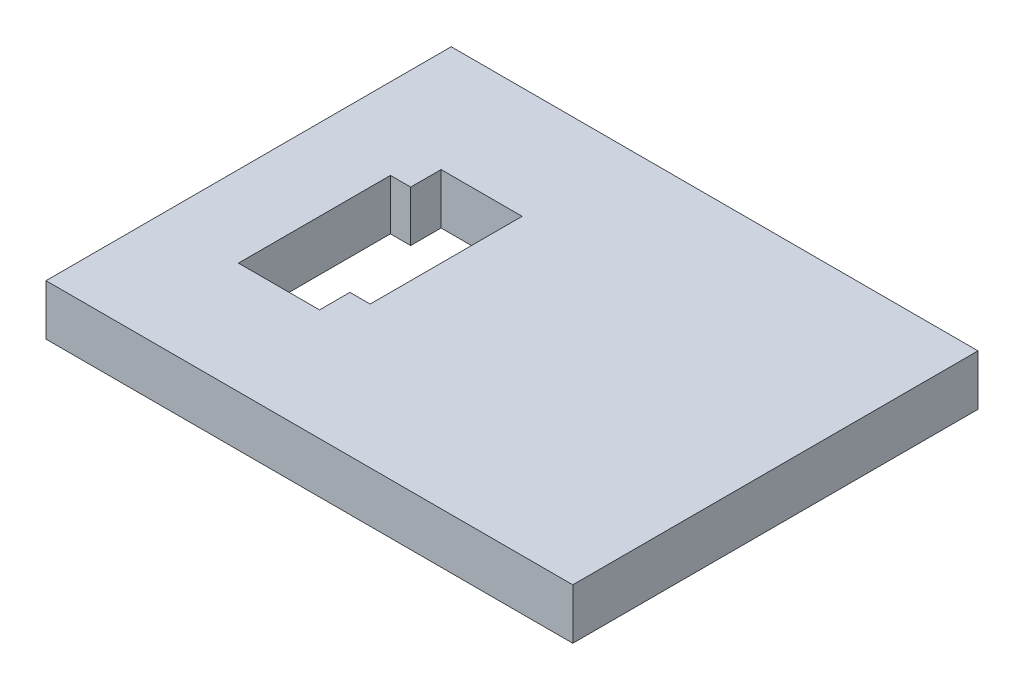
ISO-10303-21;
HEADER;
FILE_DESCRIPTION(('STEP AP214'),'2;1');
FILE_NAME('part.step','',(''),(''),'','','');
FILE_SCHEMA(('AUTOMOTIVE_DESIGN { 1 0 10303 214 1 1 1 1 }'));
ENDSEC;
DATA;
#1=APPLICATION_CONTEXT('core data for automotive mechanical design processes');
#2=APPLICATION_PROTOCOL_DEFINITION('international standard','automotive_design',2000,#1);
#3=PRODUCT_CONTEXT('',#1,'mechanical');
#4=PRODUCT('Part','Part','',(#3));
#5=PRODUCT_RELATED_PRODUCT_CATEGORY('part','',(#4));
#6=PRODUCT_DEFINITION_FORMATION('','',#4);
#7=PRODUCT_DEFINITION_CONTEXT('part definition',#1,'design');
#8=PRODUCT_DEFINITION('design','',#6,#7);
#9=PRODUCT_DEFINITION_SHAPE('','',#8);
#10=(LENGTH_UNIT() NAMED_UNIT(*) SI_UNIT(.MILLI.,.METRE.));
#11=(NAMED_UNIT(*) PLANE_ANGLE_UNIT() SI_UNIT($,.RADIAN.));
#12=(NAMED_UNIT(*) SI_UNIT($,.STERADIAN.) SOLID_ANGLE_UNIT());
#13=UNCERTAINTY_MEASURE_WITH_UNIT(LENGTH_MEASURE(1.E-05),#10,'distance_accuracy_value','');
#14=(GEOMETRIC_REPRESENTATION_CONTEXT(3) GLOBAL_UNCERTAINTY_ASSIGNED_CONTEXT((#13)) GLOBAL_UNIT_ASSIGNED_CONTEXT((#10,
#11,#12)) REPRESENTATION_CONTEXT('',''));
#15=CARTESIAN_POINT('',(0.,0.,0.));
#16=DIRECTION('',(0.,0.,1.));
#17=DIRECTION('',(1.,0.,0.));
#18=AXIS2_PLACEMENT_3D('',#15,#16,#17);
#19=CARTESIAN_POINT('',(2.,74.5000000000002,20.));
#20=DIRECTION('',(0.,0.,1.));
#21=DIRECTION('',(1.,0.,0.));
#22=AXIS2_PLACEMENT_3D('',#19,#20,#21);
#23=PLANE('',#22);
#24=DIRECTION('',(-1.,0.,0.));
#25=VECTOR('',#24,1.);
#26=CARTESIAN_POINT('',(2.,74.5000000000002,20.));
#27=LINE('',#26,#25);
#28=CARTESIAN_POINT('',(2.,74.5000000000002,20.));
#29=VERTEX_POINT('',#28);
#30=CARTESIAN_POINT('',(-50.,74.5000000000002,20.));
#31=VERTEX_POINT('',#30);
#32=EDGE_CURVE('E48',#29,#31,#27,.T.);
#33=ORIENTED_EDGE('',*,*,#32,.F.);
#34=DIRECTION('',(0.,-1.,0.));
#35=VECTOR('',#34,1.);
#36=CARTESIAN_POINT('',(2.,74.5000000000002,20.));
#37=LINE('',#36,#35);
#38=CARTESIAN_POINT('',(2.,79.5000000000002,20.));
#39=VERTEX_POINT('',#38);
#40=EDGE_CURVE('E151',#39,#29,#37,.T.);
#41=ORIENTED_EDGE('',*,*,#40,.F.);
#42=DIRECTION('',(-1.,0.,0.));
#43=VECTOR('',#42,1.);
#44=CARTESIAN_POINT('',(2.,79.5000000000002,20.));
#45=LINE('',#44,#43);
#46=CARTESIAN_POINT('',(-50.,79.5000000000002,20.));
#47=VERTEX_POINT('',#46);
#48=EDGE_CURVE('E11',#39,#47,#45,.T.);
#49=ORIENTED_EDGE('',*,*,#48,.T.);
#50=DIRECTION('',(0.,1.,0.));
#51=VECTOR('',#50,1.);
#52=CARTESIAN_POINT('',(-50.,74.5000000000002,20.));
#53=LINE('',#52,#51);
#54=EDGE_CURVE('E220',#31,#47,#53,.T.);
#55=ORIENTED_EDGE('',*,*,#54,.F.);
#56=EDGE_LOOP('',(#33,#41,#49,#55));
#57=FACE_BOUND('',#56,.T.);
#58=ADVANCED_FACE('F39',(#57),#23,.T.);
#59=CARTESIAN_POINT('',(-33.9999999999998,53.9087397180042,-1.11022302462516E-13));
#60=DIRECTION('',(1.,0.,0.));
#61=DIRECTION('',(0.,0.,-1.));
#62=AXIS2_PLACEMENT_3D('',#59,#60,#61);
#63=PLANE('',#62);
#64=DIRECTION('',(0.,1.,0.));
#65=VECTOR('',#64,1.);
#66=CARTESIAN_POINT('',(-33.9999999999998,53.9087397180042,9.00000000000012));
#67=LINE('',#66,#65);
#68=CARTESIAN_POINT('',(-33.9999999999998,74.5000000000002,9.00000000000012));
#69=VERTEX_POINT('',#68);
#70=CARTESIAN_POINT('',(-33.9999999999998,79.5000000000002,9.00000000000012));
#71=VERTEX_POINT('',#70);
#72=EDGE_CURVE('E159',#69,#71,#67,.T.);
#73=ORIENTED_EDGE('',*,*,#72,.T.);
#74=DIRECTION('',(0.,0.,-1.));
#75=VECTOR('',#74,1.);
#76=CARTESIAN_POINT('',(-33.9999999999998,79.5000000000002,-1.11022302462516E-13));
#77=LINE('',#76,#75);
#78=CARTESIAN_POINT('',(-33.9999999999998,79.5000000000002,6.00000000000012));
#79=VERTEX_POINT('',#78);
#80=EDGE_CURVE('E180',#71,#79,#77,.T.);
#81=ORIENTED_EDGE('',*,*,#80,.T.);
#82=DIRECTION('',(0.,1.,0.));
#83=VECTOR('',#82,1.);
#84=CARTESIAN_POINT('',(-33.9999999999998,53.9087397180042,6.00000000000012));
#85=LINE('',#84,#83);
#86=CARTESIAN_POINT('',(-33.9999999999998,74.5000000000002,6.00000000000012));
#87=VERTEX_POINT('',#86);
#88=EDGE_CURVE('E64',#87,#79,#85,.T.);
#89=ORIENTED_EDGE('',*,*,#88,.F.);
#90=DIRECTION('',(0.,0.,-1.));
#91=VECTOR('',#90,1.);
#92=CARTESIAN_POINT('',(-33.9999999999998,74.5000000000002,-1.11022302462516E-13));
#93=LINE('',#92,#91);
#94=EDGE_CURVE('E158',#69,#87,#93,.T.);
#95=ORIENTED_EDGE('',*,*,#94,.F.);
#96=EDGE_LOOP('',(#73,#81,#89,#95));
#97=FACE_BOUND('',#96,.T.);
#98=ADVANCED_FACE('F251',(#97),#63,.F.);
#99=CARTESIAN_POINT('',(0.,53.9087397180042,9.00000000000012));
#100=DIRECTION('',(0.,0.,-1.));
#101=DIRECTION('',(-1.,0.,0.));
#102=AXIS2_PLACEMENT_3D('',#99,#100,#101);
#103=PLANE('',#102);
#104=DIRECTION('',(-1.,0.,0.));
#105=VECTOR('',#104,1.);
#106=CARTESIAN_POINT('',(0.,74.5000000000002,9.00000000000012));
#107=LINE('',#106,#105);
#108=CARTESIAN_POINT('',(-41.9999999999998,74.5000000000002,9.00000000000012));
#109=VERTEX_POINT('',#108);
#110=EDGE_CURVE('E156',#69,#109,#107,.T.);
#111=ORIENTED_EDGE('',*,*,#110,.T.);
#112=DIRECTION('',(0.,1.,0.));
#113=VECTOR('',#112,1.);
#114=CARTESIAN_POINT('',(-41.9999999999998,53.9087397180042,9.00000000000012));
#115=LINE('',#114,#113);
#116=CARTESIAN_POINT('',(-41.9999999999998,79.5000000000002,9.00000000000012));
#117=VERTEX_POINT('',#116);
#118=EDGE_CURVE('E163',#109,#117,#115,.T.);
#119=ORIENTED_EDGE('',*,*,#118,.T.);
#120=DIRECTION('',(-1.,0.,0.));
#121=VECTOR('',#120,1.);
#122=CARTESIAN_POINT('',(0.,79.5000000000002,9.00000000000012));
#123=LINE('',#122,#121);
#124=EDGE_CURVE('E56',#71,#117,#123,.T.);
#125=ORIENTED_EDGE('',*,*,#124,.F.);
#126=ORIENTED_EDGE('',*,*,#72,.F.);
#127=EDGE_LOOP('',(#111,#119,#125,#126));
#128=FACE_BOUND('',#127,.T.);
#129=ADVANCED_FACE('F271',(#128),#103,.T.);
#130=CARTESIAN_POINT('',(-41.9999999999998,53.9087397180042,0.));
#131=DIRECTION('',(1.,0.,0.));
#132=DIRECTION('',(0.,0.,-1.));
#133=AXIS2_PLACEMENT_3D('',#130,#131,#132);
#134=PLANE('',#133);
#135=DIRECTION('',(0.,0.,-1.));
#136=VECTOR('',#135,1.);
#137=CARTESIAN_POINT('',(-41.9999999999998,74.5000000000002,0.));
#138=LINE('',#137,#136);
#139=CARTESIAN_POINT('',(-42.,74.5000000000002,-5.99999999999986));
#140=VERTEX_POINT('',#139);
#141=EDGE_CURVE('E182',#109,#140,#138,.T.);
#142=ORIENTED_EDGE('',*,*,#141,.T.);
#143=DIRECTION('',(0.,1.,0.));
#144=VECTOR('',#143,1.);
#145=CARTESIAN_POINT('',(-42.,53.9087397180042,-5.99999999999989));
#146=LINE('',#145,#144);
#147=CARTESIAN_POINT('',(-42.,79.5000000000002,-5.99999999999989));
#148=VERTEX_POINT('',#147);
#149=EDGE_CURVE('E193',#140,#148,#146,.T.);
#150=ORIENTED_EDGE('',*,*,#149,.T.);
#151=DIRECTION('',(0.,0.,-1.));
#152=VECTOR('',#151,1.);
#153=CARTESIAN_POINT('',(-41.9999999999998,79.5000000000002,0.));
#154=LINE('',#153,#152);
#155=EDGE_CURVE('E160',#117,#148,#154,.T.);
#156=ORIENTED_EDGE('',*,*,#155,.F.);
#157=ORIENTED_EDGE('',*,*,#118,.F.);
#158=EDGE_LOOP('',(#142,#150,#156,#157));
#159=FACE_BOUND('',#158,.T.);
#160=ADVANCED_FACE('F267',(#159),#134,.T.);
#161=CARTESIAN_POINT('',(0.,53.9087397180042,-6.00000000000001));
#162=DIRECTION('',(0.,0.,-1.));
#163=DIRECTION('',(-1.,0.,0.));
#164=AXIS2_PLACEMENT_3D('',#161,#162,#163);
#165=PLANE('',#164);
#166=DIRECTION('',(0.,1.,0.));
#167=VECTOR('',#166,1.);
#168=CARTESIAN_POINT('',(-40.,53.9087397180042,-6.00000000002499));
#169=LINE('',#168,#167);
#170=CARTESIAN_POINT('',(-40.,74.5000000000002,-6.00000000002499));
#171=VERTEX_POINT('',#170);
#172=CARTESIAN_POINT('',(-40.,79.5000000000002,-6.00000000002499));
#173=VERTEX_POINT('',#172);
#174=EDGE_CURVE('E194',#171,#173,#169,.T.);
#175=ORIENTED_EDGE('',*,*,#174,.T.);
#176=DIRECTION('',(-1.,0.,0.));
#177=VECTOR('',#176,1.);
#178=CARTESIAN_POINT('',(0.,79.5000000000002,-6.00000000000001));
#179=LINE('',#178,#177);
#180=EDGE_CURVE('E164',#173,#148,#179,.T.);
#181=ORIENTED_EDGE('',*,*,#180,.T.);
#182=ORIENTED_EDGE('',*,*,#149,.F.);
#183=DIRECTION('',(-1.,0.,0.));
#184=VECTOR('',#183,1.);
#185=CARTESIAN_POINT('',(0.,74.5000000000002,-6.00000000000001));
#186=LINE('',#185,#184);
#187=EDGE_CURVE('E190',#171,#140,#186,.T.);
#188=ORIENTED_EDGE('',*,*,#187,.F.);
#189=EDGE_LOOP('',(#175,#181,#182,#188));
#190=FACE_BOUND('',#189,.T.);
#191=ADVANCED_FACE('F263',(#190),#165,.F.);
#192=CARTESIAN_POINT('',(-40.,53.9087397180042,-2.50910403565285E-11));
#193=DIRECTION('',(-1.,0.,0.));
#194=DIRECTION('',(0.,0.,1.));
#195=AXIS2_PLACEMENT_3D('',#192,#193,#194);
#196=PLANE('',#195);
#197=DIRECTION('',(0.,1.,0.));
#198=VECTOR('',#197,1.);
#199=CARTESIAN_POINT('',(-40.,53.9087397180042,-9.00000000002488));
#200=LINE('',#199,#198);
#201=CARTESIAN_POINT('',(-40.,74.5000000000002,-8.9999999999999));
#202=VERTEX_POINT('',#201);
#203=CARTESIAN_POINT('',(-40.,79.5000000000002,-9.00000000002488));
#204=VERTEX_POINT('',#203);
#205=EDGE_CURVE('E198',#202,#204,#200,.T.);
#206=ORIENTED_EDGE('',*,*,#205,.T.);
#207=DIRECTION('',(0.,0.,1.));
#208=VECTOR('',#207,1.);
#209=CARTESIAN_POINT('',(-40.,79.5000000000002,-2.50910403565285E-11));
#210=LINE('',#209,#208);
#211=EDGE_CURVE('E168',#204,#173,#210,.T.);
#212=ORIENTED_EDGE('',*,*,#211,.T.);
#213=ORIENTED_EDGE('',*,*,#174,.F.);
#214=DIRECTION('',(0.,0.,1.));
#215=VECTOR('',#214,1.);
#216=CARTESIAN_POINT('',(-40.,74.5000000000002,-2.50910403565285E-11));
#217=LINE('',#216,#215);
#218=EDGE_CURVE('E195',#202,#171,#217,.T.);
#219=ORIENTED_EDGE('',*,*,#218,.F.);
#220=EDGE_LOOP('',(#206,#212,#213,#219));
#221=FACE_BOUND('',#220,.T.);
#222=ADVANCED_FACE('F259',(#221),#196,.F.);
#223=CARTESIAN_POINT('',(0.,53.9087397180042,-8.9999999999999));
#224=DIRECTION('',(0.,0.,-1.));
#225=DIRECTION('',(-1.,0.,0.));
#226=AXIS2_PLACEMENT_3D('',#223,#224,#225);
#227=PLANE('',#226);
#228=DIRECTION('',(0.,1.,0.));
#229=VECTOR('',#228,1.);
#230=CARTESIAN_POINT('',(-32.,53.9087397180042,-8.9999999999999));
#231=LINE('',#230,#229);
#232=CARTESIAN_POINT('',(-32.,74.5000000000002,-8.9999999999999));
#233=VERTEX_POINT('',#232);
#234=CARTESIAN_POINT('',(-32.,79.5000000000002,-8.9999999999999));
#235=VERTEX_POINT('',#234);
#236=EDGE_CURVE('E202',#233,#235,#231,.T.);
#237=ORIENTED_EDGE('',*,*,#236,.T.);
#238=DIRECTION('',(-1.,0.,0.));
#239=VECTOR('',#238,1.);
#240=CARTESIAN_POINT('',(0.,79.5000000000002,-8.9999999999999));
#241=LINE('',#240,#239);
#242=EDGE_CURVE('E171',#235,#204,#241,.T.);
#243=ORIENTED_EDGE('',*,*,#242,.T.);
#244=ORIENTED_EDGE('',*,*,#205,.F.);
#245=DIRECTION('',(-1.,0.,0.));
#246=VECTOR('',#245,1.);
#247=CARTESIAN_POINT('',(0.,74.5000000000002,-8.9999999999999));
#248=LINE('',#247,#246);
#249=EDGE_CURVE('E199',#233,#202,#248,.T.);
#250=ORIENTED_EDGE('',*,*,#249,.F.);
#251=EDGE_LOOP('',(#237,#243,#244,#250));
#252=FACE_BOUND('',#251,.T.);
#253=ADVANCED_FACE('F255',(#252),#227,.F.);
#254=CARTESIAN_POINT('',(-32.,53.9087397180042,0.));
#255=DIRECTION('',(1.,0.,0.));
#256=DIRECTION('',(0.,0.,-1.));
#257=AXIS2_PLACEMENT_3D('',#254,#255,#256);
#258=PLANE('',#257);
#259=DIRECTION('',(0.,1.,0.));
#260=VECTOR('',#259,1.);
#261=CARTESIAN_POINT('',(-31.9999999999998,53.9087397180042,6.00000000000012));
#262=LINE('',#261,#260);
#263=CARTESIAN_POINT('',(-31.9999999999998,74.5000000000002,6.00000000000012));
#264=VERTEX_POINT('',#263);
#265=CARTESIAN_POINT('',(-31.9999999999998,79.5000000000002,6.00000000000012));
#266=VERTEX_POINT('',#265);
#267=EDGE_CURVE('E185',#264,#266,#262,.T.);
#268=ORIENTED_EDGE('',*,*,#267,.T.);
#269=DIRECTION('',(0.,0.,-1.));
#270=VECTOR('',#269,1.);
#271=CARTESIAN_POINT('',(-32.,79.5000000000002,0.));
#272=LINE('',#271,#270);
#273=EDGE_CURVE('E174',#266,#235,#272,.T.);
#274=ORIENTED_EDGE('',*,*,#273,.T.);
#275=ORIENTED_EDGE('',*,*,#236,.F.);
#276=DIRECTION('',(0.,0.,-1.));
#277=VECTOR('',#276,1.);
#278=CARTESIAN_POINT('',(-32.,74.5000000000002,0.));
#279=LINE('',#278,#277);
#280=EDGE_CURVE('E203',#264,#233,#279,.T.);
#281=ORIENTED_EDGE('',*,*,#280,.F.);
#282=EDGE_LOOP('',(#268,#274,#275,#281));
#283=FACE_BOUND('',#282,.T.);
#284=ADVANCED_FACE('F239',(#283),#258,.F.);
#285=CARTESIAN_POINT('',(0.,53.9087397180042,6.00000000000023));
#286=DIRECTION('',(0.,0.,1.));
#287=DIRECTION('',(1.,0.,0.));
#288=AXIS2_PLACEMENT_3D('',#285,#286,#287);
#289=PLANE('',#288);
#290=ORIENTED_EDGE('',*,*,#88,.T.);
#291=DIRECTION('',(1.,0.,0.));
#292=VECTOR('',#291,1.);
#293=CARTESIAN_POINT('',(0.,79.5000000000002,6.00000000000023));
#294=LINE('',#293,#292);
#295=EDGE_CURVE('E177',#79,#266,#294,.T.);
#296=ORIENTED_EDGE('',*,*,#295,.T.);
#297=ORIENTED_EDGE('',*,*,#267,.F.);
#298=DIRECTION('',(1.,0.,0.));
#299=VECTOR('',#298,1.);
#300=CARTESIAN_POINT('',(0.,74.5000000000002,6.00000000000023));
#301=LINE('',#300,#299);
#302=EDGE_CURVE('E167',#87,#264,#301,.T.);
#303=ORIENTED_EDGE('',*,*,#302,.F.);
#304=EDGE_LOOP('',(#290,#296,#297,#303));
#305=FACE_BOUND('',#304,.T.);
#306=ADVANCED_FACE('F230',(#305),#289,.F.);
#307=CARTESIAN_POINT('',(2.,79.5000000000002,20.));
#308=DIRECTION('',(0.,1.,0.));
#309=DIRECTION('',(0.,0.,1.));
#310=AXIS2_PLACEMENT_3D('',#307,#308,#309);
#311=PLANE('',#310);
#312=ORIENTED_EDGE('',*,*,#295,.F.);
#313=ORIENTED_EDGE('',*,*,#80,.F.);
#314=ORIENTED_EDGE('',*,*,#124,.T.);
#315=ORIENTED_EDGE('',*,*,#155,.T.);
#316=ORIENTED_EDGE('',*,*,#180,.F.);
#317=ORIENTED_EDGE('',*,*,#211,.F.);
#318=ORIENTED_EDGE('',*,*,#242,.F.);
#319=ORIENTED_EDGE('',*,*,#273,.F.);
#320=EDGE_LOOP('',(#312,#313,#314,#315,#316,#317,#318,#319));
#321=FACE_BOUND('',#320,.T.);
#322=ORIENTED_EDGE('',*,*,#48,.F.);
#323=DIRECTION('',(0.,0.,1.));
#324=VECTOR('',#323,1.);
#325=CARTESIAN_POINT('',(2.,79.5000000000002,20.));
#326=LINE('',#325,#324);
#327=CARTESIAN_POINT('',(2.,79.5000000000002,-20.));
#328=VERTEX_POINT('',#327);
#329=EDGE_CURVE('E146',#328,#39,#326,.T.);
#330=ORIENTED_EDGE('',*,*,#329,.F.);
#331=DIRECTION('',(-1.,0.,0.));
#332=VECTOR('',#331,1.);
#333=CARTESIAN_POINT('',(2.,79.5000000000002,-20.));
#334=LINE('',#333,#332);
#335=CARTESIAN_POINT('',(-50.,79.5000000000002,-20.));
#336=VERTEX_POINT('',#335);
#337=EDGE_CURVE('E43',#328,#336,#334,.T.);
#338=ORIENTED_EDGE('',*,*,#337,.T.);
#339=DIRECTION('',(0.,0.,-1.));
#340=VECTOR('',#339,1.);
#341=CARTESIAN_POINT('',(-50.,79.5000000000002,20.));
#342=LINE('',#341,#340);
#343=EDGE_CURVE('E214',#47,#336,#342,.T.);
#344=ORIENTED_EDGE('',*,*,#343,.F.);
#345=EDGE_LOOP('',(#322,#330,#338,#344));
#346=FACE_BOUND('',#345,.T.);
#347=ADVANCED_FACE('F41',(#321,#346),#311,.T.);
#348=CARTESIAN_POINT('',(-50.,0.,0.));
#349=DIRECTION('',(1.,0.,0.));
#350=DIRECTION('',(0.,0.,-1.));
#351=AXIS2_PLACEMENT_3D('',#348,#349,#350);
#352=PLANE('',#351);
#353=ORIENTED_EDGE('',*,*,#343,.T.);
#354=DIRECTION('',(0.,-1.,0.));
#355=VECTOR('',#354,1.);
#356=CARTESIAN_POINT('',(-50.,74.5000000000002,-20.));
#357=LINE('',#356,#355);
#358=CARTESIAN_POINT('',(-50.,74.5000000000002,-20.));
#359=VERTEX_POINT('',#358);
#360=EDGE_CURVE('E217',#336,#359,#357,.T.);
#361=ORIENTED_EDGE('',*,*,#360,.T.);
#362=DIRECTION('',(0.,0.,1.));
#363=VECTOR('',#362,1.);
#364=CARTESIAN_POINT('',(-50.,74.5000000000002,20.));
#365=LINE('',#364,#363);
#366=EDGE_CURVE('E136',#359,#31,#365,.T.);
#367=ORIENTED_EDGE('',*,*,#366,.T.);
#368=ORIENTED_EDGE('',*,*,#54,.T.);
#369=EDGE_LOOP('',(#353,#361,#367,#368));
#370=FACE_BOUND('',#369,.T.);
#371=ADVANCED_FACE('F226',(#370),#352,.F.);
#372=CARTESIAN_POINT('',(2.,74.5000000000002,20.));
#373=DIRECTION('',(0.,-1.,0.));
#374=DIRECTION('',(0.,0.,-1.));
#375=AXIS2_PLACEMENT_3D('',#372,#373,#374);
#376=PLANE('',#375);
#377=ORIENTED_EDGE('',*,*,#302,.T.);
#378=ORIENTED_EDGE('',*,*,#280,.T.);
#379=ORIENTED_EDGE('',*,*,#249,.T.);
#380=ORIENTED_EDGE('',*,*,#218,.T.);
#381=ORIENTED_EDGE('',*,*,#187,.T.);
#382=ORIENTED_EDGE('',*,*,#141,.F.);
#383=ORIENTED_EDGE('',*,*,#110,.F.);
#384=ORIENTED_EDGE('',*,*,#94,.T.);
#385=EDGE_LOOP('',(#377,#378,#379,#380,#381,#382,#383,#384));
#386=FACE_BOUND('',#385,.T.);
#387=DIRECTION('',(-1.,0.,0.));
#388=VECTOR('',#387,1.);
#389=CARTESIAN_POINT('',(2.,74.5000000000002,-20.));
#390=LINE('',#389,#388);
#391=CARTESIAN_POINT('',(2.,74.5000000000002,-20.));
#392=VERTEX_POINT('',#391);
#393=EDGE_CURVE('E130',#392,#359,#390,.T.);
#394=ORIENTED_EDGE('',*,*,#393,.F.);
#395=DIRECTION('',(0.,0.,-1.));
#396=VECTOR('',#395,1.);
#397=CARTESIAN_POINT('',(2.,74.5000000000002,20.));
#398=LINE('',#397,#396);
#399=EDGE_CURVE('E134',#29,#392,#398,.T.);
#400=ORIENTED_EDGE('',*,*,#399,.F.);
#401=ORIENTED_EDGE('',*,*,#32,.T.);
#402=ORIENTED_EDGE('',*,*,#366,.F.);
#403=EDGE_LOOP('',(#394,#400,#401,#402));
#404=FACE_BOUND('',#403,.T.);
#405=ADVANCED_FACE('F132',(#386,#404),#376,.T.);
#406=CARTESIAN_POINT('',(2.,74.5000000000002,-20.));
#407=DIRECTION('',(0.,0.,-1.));
#408=DIRECTION('',(-1.,0.,0.));
#409=AXIS2_PLACEMENT_3D('',#406,#407,#408);
#410=PLANE('',#409);
#411=ORIENTED_EDGE('',*,*,#337,.F.);
#412=DIRECTION('',(0.,1.,0.));
#413=VECTOR('',#412,1.);
#414=CARTESIAN_POINT('',(2.,74.5000000000002,-20.));
#415=LINE('',#414,#413);
#416=EDGE_CURVE('E141',#392,#328,#415,.T.);
#417=ORIENTED_EDGE('',*,*,#416,.F.);
#418=ORIENTED_EDGE('',*,*,#393,.T.);
#419=ORIENTED_EDGE('',*,*,#360,.F.);
#420=EDGE_LOOP('',(#411,#417,#418,#419));
#421=FACE_BOUND('',#420,.T.);
#422=ADVANCED_FACE('F142',(#421),#410,.T.);
#423=CARTESIAN_POINT('',(2.,0.,0.));
#424=DIRECTION('',(1.,0.,0.));
#425=DIRECTION('',(0.,0.,-1.));
#426=AXIS2_PLACEMENT_3D('',#423,#424,#425);
#427=PLANE('',#426);
#428=ORIENTED_EDGE('',*,*,#399,.T.);
#429=ORIENTED_EDGE('',*,*,#416,.T.);
#430=ORIENTED_EDGE('',*,*,#329,.T.);
#431=ORIENTED_EDGE('',*,*,#40,.T.);
#432=EDGE_LOOP('',(#428,#429,#430,#431));
#433=FACE_BOUND('',#432,.T.);
#434=ADVANCED_FACE('F149',(#433),#427,.T.);
#435=CLOSED_SHELL('',(#58,#98,#129,#160,#191,#222,#253,#284,#306,#347,#371,#405,#422,#434));
#436=MANIFOLD_SOLID_BREP('B2',#435);
#437=ADVANCED_BREP_SHAPE_REPRESENTATION('',(#18,#436),#14);
#438=SHAPE_DEFINITION_REPRESENTATION(#9,#437);
ENDSEC;
END-ISO-10303-21;
